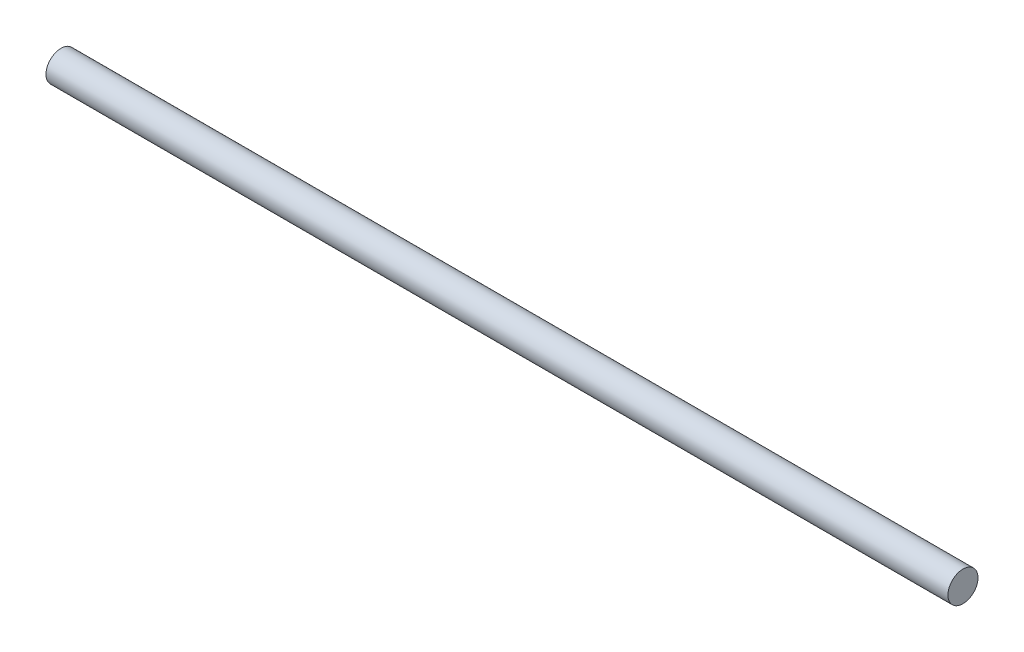
ISO-10303-21;
HEADER;
FILE_DESCRIPTION(('STEP AP214'),'2;1');
FILE_NAME('part.step','',(''),(''),'','','');
FILE_SCHEMA(('AUTOMOTIVE_DESIGN { 1 0 10303 214 1 1 1 1 }'));
ENDSEC;
DATA;
#1=APPLICATION_CONTEXT('core data for automotive mechanical design processes');
#2=APPLICATION_PROTOCOL_DEFINITION('international standard','automotive_design',2000,#1);
#3=PRODUCT_CONTEXT('',#1,'mechanical');
#4=PRODUCT('Part','Part','',(#3));
#5=PRODUCT_RELATED_PRODUCT_CATEGORY('part','',(#4));
#6=PRODUCT_DEFINITION_FORMATION('','',#4);
#7=PRODUCT_DEFINITION_CONTEXT('part definition',#1,'design');
#8=PRODUCT_DEFINITION('design','',#6,#7);
#9=PRODUCT_DEFINITION_SHAPE('','',#8);
#10=(LENGTH_UNIT() NAMED_UNIT(*) SI_UNIT(.MILLI.,.METRE.));
#11=(NAMED_UNIT(*) PLANE_ANGLE_UNIT() SI_UNIT($,.RADIAN.));
#12=(NAMED_UNIT(*) SI_UNIT($,.STERADIAN.) SOLID_ANGLE_UNIT());
#13=UNCERTAINTY_MEASURE_WITH_UNIT(LENGTH_MEASURE(1.E-05),#10,'distance_accuracy_value','');
#14=(GEOMETRIC_REPRESENTATION_CONTEXT(3) GLOBAL_UNCERTAINTY_ASSIGNED_CONTEXT((#13)) GLOBAL_UNIT_ASSIGNED_CONTEXT((#10,
#11,#12)) REPRESENTATION_CONTEXT('',''));
#15=CARTESIAN_POINT('',(0.,0.,0.));
#16=DIRECTION('',(0.,0.,1.));
#17=DIRECTION('',(1.,0.,0.));
#18=AXIS2_PLACEMENT_3D('',#15,#16,#17);
#19=CARTESIAN_POINT('',(150.,0.,0.));
#20=DIRECTION('',(-1.,0.,0.));
#21=DIRECTION('',(0.,0.,1.));
#22=AXIS2_PLACEMENT_3D('',#19,#20,#21);
#23=CYLINDRICAL_SURFACE('',#22,2.5);
#24=CARTESIAN_POINT('',(150.,0.,0.));
#25=DIRECTION('',(1.,0.,0.));
#26=DIRECTION('',(0.,0.,-1.));
#27=AXIS2_PLACEMENT_3D('',#24,#25,#26);
#28=CIRCLE('',#27,2.5);
#29=CARTESIAN_POINT('',(150.,0.,-2.5));
#30=VERTEX_POINT('',#29);
#31=EDGE_CURVE('E10',#30,#30,#28,.T.);
#32=ORIENTED_EDGE('',*,*,#31,.F.);
#33=EDGE_LOOP('',(#32));
#34=FACE_BOUND('',#33,.T.);
#35=CARTESIAN_POINT('',(0.,0.,0.));
#36=DIRECTION('',(1.,0.,0.));
#37=DIRECTION('',(0.,0.,-1.));
#38=AXIS2_PLACEMENT_3D('',#35,#36,#37);
#39=CIRCLE('',#38,2.5);
#40=CARTESIAN_POINT('',(0.,0.,-2.5));
#41=VERTEX_POINT('',#40);
#42=EDGE_CURVE('E34',#41,#41,#39,.T.);
#43=ORIENTED_EDGE('',*,*,#42,.T.);
#44=EDGE_LOOP('',(#43));
#45=FACE_BOUND('',#44,.T.);
#46=ADVANCED_FACE('F31',(#34,#45),#23,.T.);
#47=CARTESIAN_POINT('',(150.,0.,0.));
#48=DIRECTION('',(1.,0.,0.));
#49=DIRECTION('',(0.,0.,-1.));
#50=AXIS2_PLACEMENT_3D('',#47,#48,#49);
#51=PLANE('',#50);
#52=ORIENTED_EDGE('',*,*,#31,.T.);
#53=EDGE_LOOP('',(#52));
#54=FACE_BOUND('',#53,.T.);
#55=ADVANCED_FACE('F46',(#54),#51,.T.);
#56=CARTESIAN_POINT('',(0.,0.,0.));
#57=DIRECTION('',(1.,0.,0.));
#58=DIRECTION('',(0.,0.,-1.));
#59=AXIS2_PLACEMENT_3D('',#56,#57,#58);
#60=PLANE('',#59);
#61=ORIENTED_EDGE('',*,*,#42,.F.);
#62=EDGE_LOOP('',(#61));
#63=FACE_BOUND('',#62,.T.);
#64=ADVANCED_FACE('F44',(#63),#60,.F.);
#65=CLOSED_SHELL('',(#46,#55,#64));
#66=MANIFOLD_SOLID_BREP('B2',#65);
#67=ADVANCED_BREP_SHAPE_REPRESENTATION('',(#18,#66),#14);
#68=SHAPE_DEFINITION_REPRESENTATION(#9,#67);
ENDSEC;
END-ISO-10303-21;
